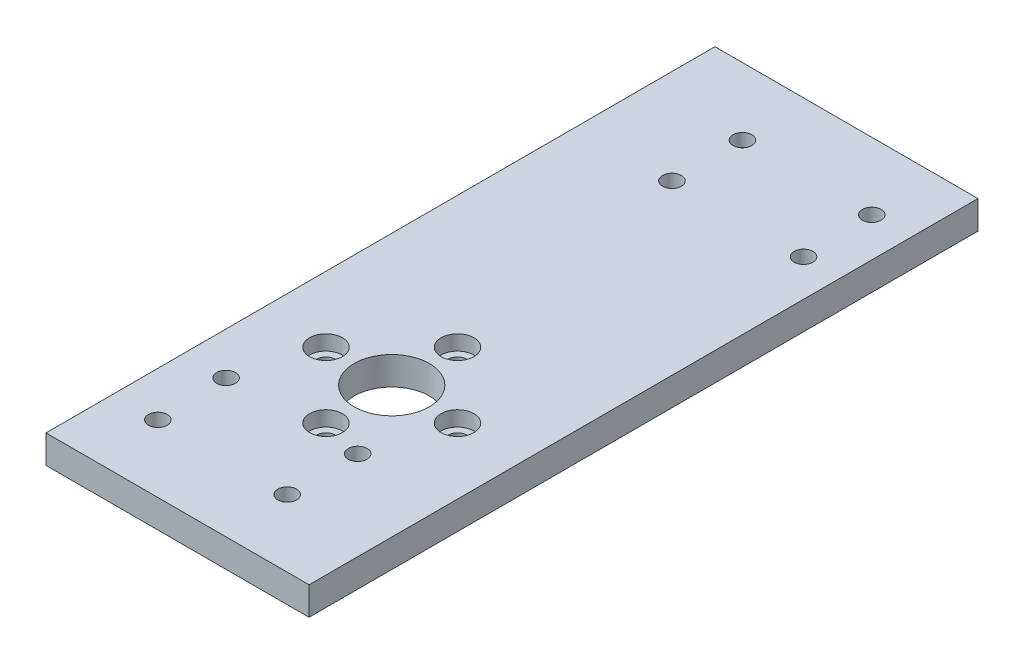
ISO-10303-21;
HEADER;
FILE_DESCRIPTION(('STEP AP214'),'2;1');
FILE_NAME('part.step','',(''),(''),'','','');
FILE_SCHEMA(('AUTOMOTIVE_DESIGN { 1 0 10303 214 1 1 1 1 }'));
ENDSEC;
DATA;
#1=APPLICATION_CONTEXT('core data for automotive mechanical design processes');
#2=APPLICATION_PROTOCOL_DEFINITION('international standard','automotive_design',2000,#1);
#3=PRODUCT_CONTEXT('',#1,'mechanical');
#4=PRODUCT('Part','Part','',(#3));
#5=PRODUCT_RELATED_PRODUCT_CATEGORY('part','',(#4));
#6=PRODUCT_DEFINITION_FORMATION('','',#4);
#7=PRODUCT_DEFINITION_CONTEXT('part definition',#1,'design');
#8=PRODUCT_DEFINITION('design','',#6,#7);
#9=PRODUCT_DEFINITION_SHAPE('','',#8);
#10=(LENGTH_UNIT() NAMED_UNIT(*) SI_UNIT(.MILLI.,.METRE.));
#11=(NAMED_UNIT(*) PLANE_ANGLE_UNIT() SI_UNIT($,.RADIAN.));
#12=(NAMED_UNIT(*) SI_UNIT($,.STERADIAN.) SOLID_ANGLE_UNIT());
#13=UNCERTAINTY_MEASURE_WITH_UNIT(LENGTH_MEASURE(1.E-05),#10,'distance_accuracy_value','');
#14=(GEOMETRIC_REPRESENTATION_CONTEXT(3) GLOBAL_UNCERTAINTY_ASSIGNED_CONTEXT((#13)) GLOBAL_UNIT_ASSIGNED_CONTEXT((#10,
#11,#12)) REPRESENTATION_CONTEXT('',''));
#15=CARTESIAN_POINT('',(0.,0.,0.));
#16=DIRECTION('',(0.,0.,1.));
#17=DIRECTION('',(1.,0.,0.));
#18=AXIS2_PLACEMENT_3D('',#15,#16,#17);
#19=CARTESIAN_POINT('',(-3.91877513505073,-7.,-28.4481628818932));
#20=DIRECTION('',(0.,1.,0.));
#21=DIRECTION('',(0.,0.,1.));
#22=AXIS2_PLACEMENT_3D('',#19,#20,#21);
#23=CYLINDRICAL_SURFACE('',#22,1.00000000000001);
#24=CARTESIAN_POINT('',(-3.91877513505073,3.,-28.4481628818932));
#25=DIRECTION('',(0.,1.,0.));
#26=DIRECTION('',(0.,0.,1.));
#27=AXIS2_PLACEMENT_3D('',#24,#25,#26);
#28=CIRCLE('',#27,1.00000000000001);
#29=CARTESIAN_POINT('',(-3.91877513505073,3.,-27.4481628818932));
#30=VERTEX_POINT('',#29);
#31=EDGE_CURVE('E241',#30,#30,#28,.T.);
#32=ORIENTED_EDGE('',*,*,#31,.T.);
#33=EDGE_LOOP('',(#32));
#34=FACE_BOUND('',#33,.T.);
#35=CARTESIAN_POINT('',(-3.91877513505073,1.6,-28.4481628818932));
#36=DIRECTION('',(0.,-1.,0.));
#37=DIRECTION('',(0.,0.,-1.));
#38=AXIS2_PLACEMENT_3D('',#35,#36,#37);
#39=CIRCLE('',#38,1.00000000000001);
#40=CARTESIAN_POINT('',(-3.91877513505073,1.6,-29.4481628818932));
#41=VERTEX_POINT('',#40);
#42=EDGE_CURVE('E40',#41,#41,#39,.F.);
#43=ORIENTED_EDGE('',*,*,#42,.F.);
#44=EDGE_LOOP('',(#43));
#45=FACE_BOUND('',#44,.T.);
#46=ADVANCED_FACE('F36',(#34,#45),#23,.F.);
#47=CARTESIAN_POINT('',(4.51877513505392,-7.,20.9481628818913));
#48=DIRECTION('',(0.,1.,0.));
#49=DIRECTION('',(0.,0.,1.));
#50=AXIS2_PLACEMENT_3D('',#47,#48,#49);
#51=CYLINDRICAL_SURFACE('',#50,1.00000000000002);
#52=CARTESIAN_POINT('',(4.51877513505392,3.,20.9481628818913));
#53=DIRECTION('',(0.,1.,0.));
#54=DIRECTION('',(0.,0.,1.));
#55=AXIS2_PLACEMENT_3D('',#52,#53,#54);
#56=CIRCLE('',#55,1.00000000000002);
#57=CARTESIAN_POINT('',(4.51877513505392,3.,21.9481628818913));
#58=VERTEX_POINT('',#57);
#59=EDGE_CURVE('E244',#58,#58,#56,.T.);
#60=ORIENTED_EDGE('',*,*,#59,.T.);
#61=EDGE_LOOP('',(#60));
#62=FACE_BOUND('',#61,.T.);
#63=CARTESIAN_POINT('',(4.51877513505392,1.6,20.9481628818913));
#64=DIRECTION('',(0.,-1.,0.));
#65=DIRECTION('',(0.,0.,-1.));
#66=AXIS2_PLACEMENT_3D('',#63,#64,#65);
#67=CIRCLE('',#66,1.00000000000002);
#68=CARTESIAN_POINT('',(4.51877513505392,1.6,19.9481628818913));
#69=VERTEX_POINT('',#68);
#70=EDGE_CURVE('E176',#69,#69,#67,.F.);
#71=ORIENTED_EDGE('',*,*,#70,.F.);
#72=EDGE_LOOP('',(#71));
#73=FACE_BOUND('',#72,.T.);
#74=ADVANCED_FACE('F277',(#62,#73),#51,.F.);
#75=CARTESIAN_POINT('',(4.51877513505393,-7.,28.4481628818913));
#76=DIRECTION('',(0.,1.,0.));
#77=DIRECTION('',(0.,0.,1.));
#78=AXIS2_PLACEMENT_3D('',#75,#76,#77);
#79=CYLINDRICAL_SURFACE('',#78,1.00000000000002);
#80=CARTESIAN_POINT('',(4.51877513505393,3.,28.4481628818913));
#81=DIRECTION('',(0.,1.,0.));
#82=DIRECTION('',(0.,0.,1.));
#83=AXIS2_PLACEMENT_3D('',#80,#81,#82);
#84=CIRCLE('',#83,1.00000000000002);
#85=CARTESIAN_POINT('',(4.51877513505393,3.,29.4481628818913));
#86=VERTEX_POINT('',#85);
#87=EDGE_CURVE('E247',#86,#86,#84,.T.);
#88=ORIENTED_EDGE('',*,*,#87,.T.);
#89=EDGE_LOOP('',(#88));
#90=FACE_BOUND('',#89,.T.);
#91=CARTESIAN_POINT('',(4.51877513505393,1.6,28.4481628818913));
#92=DIRECTION('',(0.,-1.,0.));
#93=DIRECTION('',(0.,0.,-1.));
#94=AXIS2_PLACEMENT_3D('',#91,#92,#93);
#95=CIRCLE('',#94,1.00000000000002);
#96=CARTESIAN_POINT('',(4.51877513505393,1.6,27.4481628818913));
#97=VERTEX_POINT('',#96);
#98=EDGE_CURVE('E172',#97,#97,#95,.F.);
#99=ORIENTED_EDGE('',*,*,#98,.F.);
#100=EDGE_LOOP('',(#99));
#101=FACE_BOUND('',#100,.T.);
#102=ADVANCED_FACE('F283',(#90,#101),#79,.F.);
#103=CARTESIAN_POINT('',(-9.48122486494609,-7.,20.9481628818913));
#104=DIRECTION('',(0.,1.,0.));
#105=DIRECTION('',(0.,0.,1.));
#106=AXIS2_PLACEMENT_3D('',#103,#104,#105);
#107=CYLINDRICAL_SURFACE('',#106,1.00000000000001);
#108=CARTESIAN_POINT('',(-9.48122486494609,3.,20.9481628818913));
#109=DIRECTION('',(0.,1.,0.));
#110=DIRECTION('',(0.,0.,1.));
#111=AXIS2_PLACEMENT_3D('',#108,#109,#110);
#112=CIRCLE('',#111,1.00000000000001);
#113=CARTESIAN_POINT('',(-9.48122486494609,3.,21.9481628818913));
#114=VERTEX_POINT('',#113);
#115=EDGE_CURVE('E253',#114,#114,#112,.T.);
#116=ORIENTED_EDGE('',*,*,#115,.T.);
#117=EDGE_LOOP('',(#116));
#118=FACE_BOUND('',#117,.T.);
#119=CARTESIAN_POINT('',(-9.48122486494609,1.6,20.9481628818913));
#120=DIRECTION('',(0.,-1.,0.));
#121=DIRECTION('',(0.,0.,-1.));
#122=AXIS2_PLACEMENT_3D('',#119,#120,#121);
#123=CIRCLE('',#122,1.00000000000001);
#124=CARTESIAN_POINT('',(-9.48122486494609,1.6,19.9481628818913));
#125=VERTEX_POINT('',#124);
#126=EDGE_CURVE('E167',#125,#125,#123,.F.);
#127=ORIENTED_EDGE('',*,*,#126,.F.);
#128=EDGE_LOOP('',(#127));
#129=FACE_BOUND('',#128,.T.);
#130=ADVANCED_FACE('F293',(#118,#129),#107,.F.);
#131=CARTESIAN_POINT('',(-9.24883244467996,-7.,28.4481628818913));
#132=DIRECTION('',(0.,1.,0.));
#133=DIRECTION('',(0.,0.,1.));
#134=AXIS2_PLACEMENT_3D('',#131,#132,#133);
#135=CYLINDRICAL_SURFACE('',#134,1.00000000000001);
#136=CARTESIAN_POINT('',(-9.24883244467996,3.,28.4481628818913));
#137=DIRECTION('',(0.,1.,0.));
#138=DIRECTION('',(0.,0.,1.));
#139=AXIS2_PLACEMENT_3D('',#136,#137,#138);
#140=CIRCLE('',#139,1.00000000000001);
#141=CARTESIAN_POINT('',(-9.24883244467996,3.,29.4481628818913));
#142=VERTEX_POINT('',#141);
#143=EDGE_CURVE('E250',#142,#142,#140,.T.);
#144=ORIENTED_EDGE('',*,*,#143,.T.);
#145=EDGE_LOOP('',(#144));
#146=FACE_BOUND('',#145,.T.);
#147=CARTESIAN_POINT('',(-9.24883244467996,1.6,28.4481628818913));
#148=DIRECTION('',(0.,-1.,0.));
#149=DIRECTION('',(0.,0.,-1.));
#150=AXIS2_PLACEMENT_3D('',#147,#148,#149);
#151=CIRCLE('',#150,1.00000000000001);
#152=CARTESIAN_POINT('',(-9.24883244467996,1.6,27.4481628818913));
#153=VERTEX_POINT('',#152);
#154=EDGE_CURVE('E162',#153,#153,#151,.F.);
#155=ORIENTED_EDGE('',*,*,#154,.F.);
#156=EDGE_LOOP('',(#155));
#157=FACE_BOUND('',#156,.T.);
#158=ADVANCED_FACE('F295',(#146,#157),#135,.F.);
#159=CARTESIAN_POINT('',(10.0812248649493,-7.,-20.9481628818932));
#160=DIRECTION('',(0.,1.,0.));
#161=DIRECTION('',(0.,0.,1.));
#162=AXIS2_PLACEMENT_3D('',#159,#160,#161);
#163=CYLINDRICAL_SURFACE('',#162,1.);
#164=CARTESIAN_POINT('',(10.0812248649493,3.,-20.9481628818932));
#165=DIRECTION('',(0.,1.,0.));
#166=DIRECTION('',(0.,0.,1.));
#167=AXIS2_PLACEMENT_3D('',#164,#165,#166);
#168=CIRCLE('',#167,1.);
#169=CARTESIAN_POINT('',(10.0812248649493,3.,-19.9481628818932));
#170=VERTEX_POINT('',#169);
#171=EDGE_CURVE('E235',#170,#170,#168,.T.);
#172=ORIENTED_EDGE('',*,*,#171,.T.);
#173=EDGE_LOOP('',(#172));
#174=FACE_BOUND('',#173,.T.);
#175=CARTESIAN_POINT('',(10.0812248649493,1.6,-20.9481628818932));
#176=DIRECTION('',(0.,-1.,0.));
#177=DIRECTION('',(0.,0.,-1.));
#178=AXIS2_PLACEMENT_3D('',#175,#176,#177);
#179=CIRCLE('',#178,1.);
#180=CARTESIAN_POINT('',(10.0812248649493,1.6,-21.9481628818932));
#181=VERTEX_POINT('',#180);
#182=EDGE_CURVE('E157',#181,#181,#179,.F.);
#183=ORIENTED_EDGE('',*,*,#182,.F.);
#184=EDGE_LOOP('',(#183));
#185=FACE_BOUND('',#184,.T.);
#186=ADVANCED_FACE('F298',(#174,#185),#163,.F.);
#187=CARTESIAN_POINT('',(9.84883244468316,-7.,-28.4481628818932));
#188=DIRECTION('',(0.,1.,0.));
#189=DIRECTION('',(0.,0.,1.));
#190=AXIS2_PLACEMENT_3D('',#187,#188,#189);
#191=CYLINDRICAL_SURFACE('',#190,1.00000000000001);
#192=CARTESIAN_POINT('',(9.84883244468316,3.,-28.4481628818932));
#193=DIRECTION('',(0.,1.,0.));
#194=DIRECTION('',(0.,0.,1.));
#195=AXIS2_PLACEMENT_3D('',#192,#193,#194);
#196=CIRCLE('',#195,1.00000000000001);
#197=CARTESIAN_POINT('',(9.84883244468316,3.,-27.4481628818932));
#198=VERTEX_POINT('',#197);
#199=EDGE_CURVE('E238',#198,#198,#196,.T.);
#200=ORIENTED_EDGE('',*,*,#199,.T.);
#201=EDGE_LOOP('',(#200));
#202=FACE_BOUND('',#201,.T.);
#203=CARTESIAN_POINT('',(9.84883244468316,1.6,-28.4481628818932));
#204=DIRECTION('',(0.,-1.,0.));
#205=DIRECTION('',(0.,0.,-1.));
#206=AXIS2_PLACEMENT_3D('',#203,#204,#205);
#207=CIRCLE('',#206,1.00000000000001);
#208=CARTESIAN_POINT('',(9.84883244468316,1.6,-29.4481628818932));
#209=VERTEX_POINT('',#208);
#210=EDGE_CURVE('E152',#209,#209,#207,.F.);
#211=ORIENTED_EDGE('',*,*,#210,.F.);
#212=EDGE_LOOP('',(#211));
#213=FACE_BOUND('',#212,.T.);
#214=ADVANCED_FACE('F288',(#202,#213),#191,.F.);
#215=CARTESIAN_POINT('',(-3.91877513505072,-7.,-20.9481628818932));
#216=DIRECTION('',(0.,1.,0.));
#217=DIRECTION('',(0.,0.,1.));
#218=AXIS2_PLACEMENT_3D('',#215,#216,#217);
#219=CYLINDRICAL_SURFACE('',#218,1.00000000000001);
#220=CARTESIAN_POINT('',(-3.91877513505072,3.,-20.9481628818932));
#221=DIRECTION('',(0.,1.,0.));
#222=DIRECTION('',(0.,0.,1.));
#223=AXIS2_PLACEMENT_3D('',#220,#221,#222);
#224=CIRCLE('',#223,1.00000000000001);
#225=CARTESIAN_POINT('',(-3.91877513505072,3.,-19.9481628818932));
#226=VERTEX_POINT('',#225);
#227=EDGE_CURVE('E130',#226,#226,#224,.T.);
#228=ORIENTED_EDGE('',*,*,#227,.T.);
#229=EDGE_LOOP('',(#228));
#230=FACE_BOUND('',#229,.T.);
#231=CARTESIAN_POINT('',(-3.91877513505072,1.6,-20.9481628818932));
#232=DIRECTION('',(0.,-1.,0.));
#233=DIRECTION('',(0.,0.,-1.));
#234=AXIS2_PLACEMENT_3D('',#231,#232,#233);
#235=CIRCLE('',#234,1.00000000000001);
#236=CARTESIAN_POINT('',(-3.91877513505072,1.6,-21.9481628818932));
#237=VERTEX_POINT('',#236);
#238=EDGE_CURVE('E147',#237,#237,#235,.F.);
#239=ORIENTED_EDGE('',*,*,#238,.F.);
#240=EDGE_LOOP('',(#239));
#241=FACE_BOUND('',#240,.T.);
#242=ADVANCED_FACE('F318',(#230,#241),#219,.F.);
#243=CARTESIAN_POINT('',(7.0000000000001,-7.,12.7999999999978));
#244=DIRECTION('',(0.,1.,0.));
#245=DIRECTION('',(0.,0.,1.));
#246=AXIS2_PLACEMENT_3D('',#243,#244,#245);
#247=CYLINDRICAL_SURFACE('',#246,1.);
#248=CARTESIAN_POINT('',(7.0000000000001,0.,12.7999999999978));
#249=DIRECTION('',(0.,-1.,0.));
#250=DIRECTION('',(0.,0.,-1.));
#251=AXIS2_PLACEMENT_3D('',#248,#249,#250);
#252=CIRCLE('',#251,1.);
#253=CARTESIAN_POINT('',(7.0000000000001,0.,11.7999999999978));
#254=VERTEX_POINT('',#253);
#255=EDGE_CURVE('E114',#254,#254,#252,.T.);
#256=ORIENTED_EDGE('',*,*,#255,.T.);
#257=EDGE_LOOP('',(#256));
#258=FACE_BOUND('',#257,.T.);
#259=CARTESIAN_POINT('',(7.0000000000001,1.4,12.7999999999978));
#260=DIRECTION('',(0.,1.,0.));
#261=DIRECTION('',(0.,0.,1.));
#262=AXIS2_PLACEMENT_3D('',#259,#260,#261);
#263=CIRCLE('',#262,1.);
#264=CARTESIAN_POINT('',(7.0000000000001,1.4,13.7999999999978));
#265=VERTEX_POINT('',#264);
#266=EDGE_CURVE('E142',#265,#265,#263,.F.);
#267=ORIENTED_EDGE('',*,*,#266,.F.);
#268=EDGE_LOOP('',(#267));
#269=FACE_BOUND('',#268,.T.);
#270=ADVANCED_FACE('F311',(#258,#269),#247,.F.);
#271=CARTESIAN_POINT('',(-6.9999999999999,-7.,12.7999999999979));
#272=DIRECTION('',(0.,1.,0.));
#273=DIRECTION('',(0.,0.,1.));
#274=AXIS2_PLACEMENT_3D('',#271,#272,#273);
#275=CYLINDRICAL_SURFACE('',#274,1.);
#276=CARTESIAN_POINT('',(-6.9999999999999,0.,12.7999999999979));
#277=DIRECTION('',(0.,-1.,0.));
#278=DIRECTION('',(0.,0.,-1.));
#279=AXIS2_PLACEMENT_3D('',#276,#277,#278);
#280=CIRCLE('',#279,1.);
#281=CARTESIAN_POINT('',(-6.9999999999999,0.,11.7999999999979));
#282=VERTEX_POINT('',#281);
#283=EDGE_CURVE('E120',#282,#282,#280,.T.);
#284=ORIENTED_EDGE('',*,*,#283,.T.);
#285=EDGE_LOOP('',(#284));
#286=FACE_BOUND('',#285,.T.);
#287=CARTESIAN_POINT('',(-6.9999999999999,1.4,12.7999999999979));
#288=DIRECTION('',(0.,1.,0.));
#289=DIRECTION('',(0.,0.,1.));
#290=AXIS2_PLACEMENT_3D('',#287,#288,#289);
#291=CIRCLE('',#290,1.);
#292=CARTESIAN_POINT('',(-6.9999999999999,1.4,13.7999999999979));
#293=VERTEX_POINT('',#292);
#294=EDGE_CURVE('E137',#293,#293,#291,.F.);
#295=ORIENTED_EDGE('',*,*,#294,.F.);
#296=EDGE_LOOP('',(#295));
#297=FACE_BOUND('',#296,.T.);
#298=ADVANCED_FACE('F307',(#286,#297),#275,.F.);
#299=CARTESIAN_POINT('',(0.,-7.,5.79999999999792));
#300=DIRECTION('',(0.,1.,0.));
#301=DIRECTION('',(0.,0.,1.));
#302=AXIS2_PLACEMENT_3D('',#299,#300,#301);
#303=CYLINDRICAL_SURFACE('',#302,1.);
#304=CARTESIAN_POINT('',(0.,0.,5.79999999999792));
#305=DIRECTION('',(0.,-1.,0.));
#306=DIRECTION('',(0.,0.,-1.));
#307=AXIS2_PLACEMENT_3D('',#304,#305,#306);
#308=CIRCLE('',#307,1.);
#309=CARTESIAN_POINT('',(0.,0.,4.79999999999792));
#310=VERTEX_POINT('',#309);
#311=EDGE_CURVE('E106',#310,#310,#308,.T.);
#312=ORIENTED_EDGE('',*,*,#311,.T.);
#313=EDGE_LOOP('',(#312));
#314=FACE_BOUND('',#313,.T.);
#315=CARTESIAN_POINT('',(0.,1.4,5.79999999999792));
#316=DIRECTION('',(0.,1.,0.));
#317=DIRECTION('',(0.,0.,1.));
#318=AXIS2_PLACEMENT_3D('',#315,#316,#317);
#319=CIRCLE('',#318,1.);
#320=CARTESIAN_POINT('',(0.,1.4,6.79999999999792));
#321=VERTEX_POINT('',#320);
#322=EDGE_CURVE('E132',#321,#321,#319,.F.);
#323=ORIENTED_EDGE('',*,*,#322,.F.);
#324=EDGE_LOOP('',(#323));
#325=FACE_BOUND('',#324,.T.);
#326=ADVANCED_FACE('F310',(#314,#325),#303,.F.);
#327=CARTESIAN_POINT('',(1.45764745514838E-13,-7.,19.7999999999979));
#328=DIRECTION('',(0.,1.,0.));
#329=DIRECTION('',(0.,0.,1.));
#330=AXIS2_PLACEMENT_3D('',#327,#328,#329);
#331=CYLINDRICAL_SURFACE('',#330,1.);
#332=CARTESIAN_POINT('',(1.45764745514838E-13,0.,19.7999999999979));
#333=DIRECTION('',(0.,-1.,0.));
#334=DIRECTION('',(0.,0.,-1.));
#335=AXIS2_PLACEMENT_3D('',#332,#333,#334);
#336=CIRCLE('',#335,1.);
#337=CARTESIAN_POINT('',(1.45764745514838E-13,0.,18.7999999999979));
#338=VERTEX_POINT('',#337);
#339=EDGE_CURVE('E117',#338,#338,#336,.T.);
#340=ORIENTED_EDGE('',*,*,#339,.T.);
#341=EDGE_LOOP('',(#340));
#342=FACE_BOUND('',#341,.T.);
#343=CARTESIAN_POINT('',(1.45764745514838E-13,1.4,19.7999999999979));
#344=DIRECTION('',(0.,1.,0.));
#345=DIRECTION('',(0.,0.,1.));
#346=AXIS2_PLACEMENT_3D('',#343,#344,#345);
#347=CIRCLE('',#346,1.);
#348=CARTESIAN_POINT('',(1.45764745514838E-13,1.4,20.7999999999979));
#349=VERTEX_POINT('',#348);
#350=EDGE_CURVE('E127',#349,#349,#347,.F.);
#351=ORIENTED_EDGE('',*,*,#350,.F.);
#352=EDGE_LOOP('',(#351));
#353=FACE_BOUND('',#352,.T.);
#354=ADVANCED_FACE('F313',(#342,#353),#331,.F.);
#355=CARTESIAN_POINT('',(14.,3.,35.6));
#356=DIRECTION('',(-1.,0.,0.));
#357=DIRECTION('',(0.,0.,1.));
#358=AXIS2_PLACEMENT_3D('',#355,#356,#357);
#359=PLANE('',#358);
#360=DIRECTION('',(0.,0.,-1.));
#361=VECTOR('',#360,1.);
#362=CARTESIAN_POINT('',(14.,0.,35.6));
#363=LINE('',#362,#361);
#364=CARTESIAN_POINT('',(14.,0.,35.6));
#365=VERTEX_POINT('',#364);
#366=CARTESIAN_POINT('',(14.,0.,-35.6));
#367=VERTEX_POINT('',#366);
#368=EDGE_CURVE('E103',#365,#367,#363,.T.);
#369=ORIENTED_EDGE('',*,*,#368,.T.);
#370=DIRECTION('',(0.,-1.,0.));
#371=VECTOR('',#370,1.);
#372=CARTESIAN_POINT('',(14.,3.,-35.6));
#373=LINE('',#372,#371);
#374=CARTESIAN_POINT('',(14.,3.,-35.6));
#375=VERTEX_POINT('',#374);
#376=EDGE_CURVE('E11',#375,#367,#373,.T.);
#377=ORIENTED_EDGE('',*,*,#376,.F.);
#378=DIRECTION('',(0.,0.,-1.));
#379=VECTOR('',#378,1.);
#380=CARTESIAN_POINT('',(14.,3.,35.6));
#381=LINE('',#380,#379);
#382=CARTESIAN_POINT('',(14.,3.,35.6));
#383=VERTEX_POINT('',#382);
#384=EDGE_CURVE('E90',#383,#375,#381,.T.);
#385=ORIENTED_EDGE('',*,*,#384,.F.);
#386=DIRECTION('',(0.,-1.,0.));
#387=VECTOR('',#386,1.);
#388=CARTESIAN_POINT('',(14.,3.,35.6));
#389=LINE('',#388,#387);
#390=EDGE_CURVE('E99',#383,#365,#389,.T.);
#391=ORIENTED_EDGE('',*,*,#390,.T.);
#392=EDGE_LOOP('',(#369,#377,#385,#391));
#393=FACE_BOUND('',#392,.T.);
#394=ADVANCED_FACE('F38',(#393),#359,.F.);
#395=CARTESIAN_POINT('',(-14.,3.,-35.6));
#396=DIRECTION('',(0.,0.,1.));
#397=DIRECTION('',(1.,0.,0.));
#398=AXIS2_PLACEMENT_3D('',#395,#396,#397);
#399=PLANE('',#398);
#400=DIRECTION('',(-1.,0.,0.));
#401=VECTOR('',#400,1.);
#402=CARTESIAN_POINT('',(-14.,0.,-35.6));
#403=LINE('',#402,#401);
#404=CARTESIAN_POINT('',(-14.,0.,-35.6));
#405=VERTEX_POINT('',#404);
#406=EDGE_CURVE('E94',#367,#405,#403,.T.);
#407=ORIENTED_EDGE('',*,*,#406,.T.);
#408=DIRECTION('',(0.,-1.,0.));
#409=VECTOR('',#408,1.);
#410=CARTESIAN_POINT('',(-14.,3.,-35.6));
#411=LINE('',#410,#409);
#412=CARTESIAN_POINT('',(-14.,3.,-35.6));
#413=VERTEX_POINT('',#412);
#414=EDGE_CURVE('E46',#413,#405,#411,.T.);
#415=ORIENTED_EDGE('',*,*,#414,.F.);
#416=DIRECTION('',(-1.,0.,0.));
#417=VECTOR('',#416,1.);
#418=CARTESIAN_POINT('',(-14.,3.,-35.6));
#419=LINE('',#418,#417);
#420=EDGE_CURVE('E85',#375,#413,#419,.T.);
#421=ORIENTED_EDGE('',*,*,#420,.F.);
#422=ORIENTED_EDGE('',*,*,#376,.T.);
#423=EDGE_LOOP('',(#407,#415,#421,#422));
#424=FACE_BOUND('',#423,.T.);
#425=ADVANCED_FACE('F93',(#424),#399,.F.);
#426=CARTESIAN_POINT('',(-14.,3.,35.6));
#427=DIRECTION('',(1.,0.,0.));
#428=DIRECTION('',(0.,0.,-1.));
#429=AXIS2_PLACEMENT_3D('',#426,#427,#428);
#430=PLANE('',#429);
#431=DIRECTION('',(0.,0.,1.));
#432=VECTOR('',#431,1.);
#433=CARTESIAN_POINT('',(-14.,0.,35.6));
#434=LINE('',#433,#432);
#435=CARTESIAN_POINT('',(-14.,0.,35.6));
#436=VERTEX_POINT('',#435);
#437=EDGE_CURVE('E72',#405,#436,#434,.T.);
#438=ORIENTED_EDGE('',*,*,#437,.T.);
#439=DIRECTION('',(0.,-1.,0.));
#440=VECTOR('',#439,1.);
#441=CARTESIAN_POINT('',(-14.,3.,35.6));
#442=LINE('',#441,#440);
#443=CARTESIAN_POINT('',(-14.,3.,35.6));
#444=VERTEX_POINT('',#443);
#445=EDGE_CURVE('E95',#444,#436,#442,.T.);
#446=ORIENTED_EDGE('',*,*,#445,.F.);
#447=DIRECTION('',(0.,0.,1.));
#448=VECTOR('',#447,1.);
#449=CARTESIAN_POINT('',(-14.,3.,35.6));
#450=LINE('',#449,#448);
#451=EDGE_CURVE('E88',#413,#444,#450,.T.);
#452=ORIENTED_EDGE('',*,*,#451,.F.);
#453=ORIENTED_EDGE('',*,*,#414,.T.);
#454=EDGE_LOOP('',(#438,#446,#452,#453));
#455=FACE_BOUND('',#454,.T.);
#456=ADVANCED_FACE('F97',(#455),#430,.F.);
#457=CARTESIAN_POINT('',(-14.,3.,35.6));
#458=DIRECTION('',(0.,0.,-1.));
#459=DIRECTION('',(-1.,0.,0.));
#460=AXIS2_PLACEMENT_3D('',#457,#458,#459);
#461=PLANE('',#460);
#462=DIRECTION('',(1.,0.,0.));
#463=VECTOR('',#462,1.);
#464=CARTESIAN_POINT('',(-14.,0.,35.6));
#465=LINE('',#464,#463);
#466=EDGE_CURVE('E78',#436,#365,#465,.T.);
#467=ORIENTED_EDGE('',*,*,#466,.T.);
#468=ORIENTED_EDGE('',*,*,#390,.F.);
#469=DIRECTION('',(1.,0.,0.));
#470=VECTOR('',#469,1.);
#471=CARTESIAN_POINT('',(-14.,3.,35.6));
#472=LINE('',#471,#470);
#473=EDGE_CURVE('E55',#444,#383,#472,.T.);
#474=ORIENTED_EDGE('',*,*,#473,.F.);
#475=ORIENTED_EDGE('',*,*,#445,.T.);
#476=EDGE_LOOP('',(#467,#468,#474,#475));
#477=FACE_BOUND('',#476,.T.);
#478=ADVANCED_FACE('F263',(#477),#461,.F.);
#479=CARTESIAN_POINT('',(0.,3.,0.));
#480=DIRECTION('',(0.,-1.,0.));
#481=DIRECTION('',(0.,0.,-1.));
#482=AXIS2_PLACEMENT_3D('',#479,#480,#481);
#483=PLANE('',#482);
#484=CARTESIAN_POINT('',(7.0000000000001,3.,12.7999999999978));
#485=DIRECTION('',(0.,1.,0.));
#486=DIRECTION('',(0.,0.,1.));
#487=AXIS2_PLACEMENT_3D('',#484,#485,#486);
#488=CIRCLE('',#487,1.75);
#489=CARTESIAN_POINT('',(7.0000000000001,3.,14.5499999999978));
#490=VERTEX_POINT('',#489);
#491=EDGE_CURVE('E150',#490,#490,#488,.T.);
#492=ORIENTED_EDGE('',*,*,#491,.F.);
#493=EDGE_LOOP('',(#492));
#494=FACE_BOUND('',#493,.T.);
#495=CARTESIAN_POINT('',(-6.9999999999999,3.,12.7999999999979));
#496=DIRECTION('',(0.,1.,0.));
#497=DIRECTION('',(0.,0.,1.));
#498=AXIS2_PLACEMENT_3D('',#495,#496,#497);
#499=CIRCLE('',#498,1.75);
#500=CARTESIAN_POINT('',(-6.9999999999999,3.,14.5499999999979));
#501=VERTEX_POINT('',#500);
#502=EDGE_CURVE('E145',#501,#501,#499,.T.);
#503=ORIENTED_EDGE('',*,*,#502,.F.);
#504=EDGE_LOOP('',(#503));
#505=FACE_BOUND('',#504,.T.);
#506=CARTESIAN_POINT('',(0.,3.,5.79999999999792));
#507=DIRECTION('',(0.,1.,0.));
#508=DIRECTION('',(0.,0.,1.));
#509=AXIS2_PLACEMENT_3D('',#506,#507,#508);
#510=CIRCLE('',#509,1.75);
#511=CARTESIAN_POINT('',(0.,3.,7.54999999999792));
#512=VERTEX_POINT('',#511);
#513=EDGE_CURVE('E140',#512,#512,#510,.T.);
#514=ORIENTED_EDGE('',*,*,#513,.F.);
#515=EDGE_LOOP('',(#514));
#516=FACE_BOUND('',#515,.T.);
#517=CARTESIAN_POINT('',(1.45764745514838E-13,3.,19.7999999999979));
#518=DIRECTION('',(0.,1.,0.));
#519=DIRECTION('',(0.,0.,1.));
#520=AXIS2_PLACEMENT_3D('',#517,#518,#519);
#521=CIRCLE('',#520,1.75);
#522=CARTESIAN_POINT('',(1.45764745514838E-13,3.,21.5499999999979));
#523=VERTEX_POINT('',#522);
#524=EDGE_CURVE('E135',#523,#523,#521,.T.);
#525=ORIENTED_EDGE('',*,*,#524,.F.);
#526=EDGE_LOOP('',(#525));
#527=FACE_BOUND('',#526,.T.);
#528=ORIENTED_EDGE('',*,*,#227,.F.);
#529=EDGE_LOOP('',(#528));
#530=FACE_BOUND('',#529,.T.);
#531=ORIENTED_EDGE('',*,*,#171,.F.);
#532=EDGE_LOOP('',(#531));
#533=FACE_BOUND('',#532,.T.);
#534=ORIENTED_EDGE('',*,*,#199,.F.);
#535=EDGE_LOOP('',(#534));
#536=FACE_BOUND('',#535,.T.);
#537=ORIENTED_EDGE('',*,*,#31,.F.);
#538=EDGE_LOOP('',(#537));
#539=FACE_BOUND('',#538,.T.);
#540=ORIENTED_EDGE('',*,*,#59,.F.);
#541=EDGE_LOOP('',(#540));
#542=FACE_BOUND('',#541,.T.);
#543=ORIENTED_EDGE('',*,*,#87,.F.);
#544=EDGE_LOOP('',(#543));
#545=FACE_BOUND('',#544,.T.);
#546=ORIENTED_EDGE('',*,*,#143,.F.);
#547=EDGE_LOOP('',(#546));
#548=FACE_BOUND('',#547,.T.);
#549=ORIENTED_EDGE('',*,*,#115,.F.);
#550=EDGE_LOOP('',(#549));
#551=FACE_BOUND('',#550,.T.);
#552=CARTESIAN_POINT('',(0.,3.,12.7999999999985));
#553=DIRECTION('',(0.,1.,0.));
#554=DIRECTION('',(0.,0.,1.));
#555=AXIS2_PLACEMENT_3D('',#552,#553,#554);
#556=CIRCLE('',#555,4.);
#557=CARTESIAN_POINT('',(0.,3.,16.7999999999985));
#558=VERTEX_POINT('',#557);
#559=EDGE_CURVE('E126',#558,#558,#556,.T.);
#560=ORIENTED_EDGE('',*,*,#559,.F.);
#561=EDGE_LOOP('',(#560));
#562=FACE_BOUND('',#561,.T.);
#563=ORIENTED_EDGE('',*,*,#384,.T.);
#564=ORIENTED_EDGE('',*,*,#420,.T.);
#565=ORIENTED_EDGE('',*,*,#451,.T.);
#566=ORIENTED_EDGE('',*,*,#473,.T.);
#567=EDGE_LOOP('',(#563,#564,#565,#566));
#568=FACE_BOUND('',#567,.T.);
#569=ADVANCED_FACE('F86',(#494,#505,#516,#527,#530,#533,#536,#539,#542,#545,#548,#551,#562,
#568),#483,.F.);
#570=CARTESIAN_POINT('',(0.,0.,0.));
#571=DIRECTION('',(0.,-1.,0.));
#572=DIRECTION('',(0.,0.,-1.));
#573=AXIS2_PLACEMENT_3D('',#570,#571,#572);
#574=PLANE('',#573);
#575=CARTESIAN_POINT('',(-3.91877513505052,0.,-28.4481628818932));
#576=DIRECTION('',(0.,-1.,0.));
#577=DIRECTION('',(0.,0.,-1.));
#578=AXIS2_PLACEMENT_3D('',#575,#576,#577);
#579=CIRCLE('',#578,1.75);
#580=CARTESIAN_POINT('',(-3.91877513505052,0.,-30.1981628818932));
#581=VERTEX_POINT('',#580);
#582=EDGE_CURVE('E192',#581,#581,#579,.T.);
#583=ORIENTED_EDGE('',*,*,#582,.F.);
#584=EDGE_LOOP('',(#583));
#585=FACE_BOUND('',#584,.T.);
#586=CARTESIAN_POINT('',(4.51877513505412,0.,20.9481628818913));
#587=DIRECTION('',(0.,-1.,0.));
#588=DIRECTION('',(0.,0.,-1.));
#589=AXIS2_PLACEMENT_3D('',#586,#587,#588);
#590=CIRCLE('',#589,1.74999999999999);
#591=CARTESIAN_POINT('',(4.51877513505412,0.,19.1981628818913));
#592=VERTEX_POINT('',#591);
#593=EDGE_CURVE('E185',#592,#592,#590,.T.);
#594=ORIENTED_EDGE('',*,*,#593,.F.);
#595=EDGE_LOOP('',(#594));
#596=FACE_BOUND('',#595,.T.);
#597=CARTESIAN_POINT('',(4.51877513505413,0.,28.4481628818913));
#598=DIRECTION('',(0.,-1.,0.));
#599=DIRECTION('',(0.,0.,-1.));
#600=AXIS2_PLACEMENT_3D('',#597,#598,#599);
#601=CIRCLE('',#600,1.74999999999999);
#602=CARTESIAN_POINT('',(4.51877513505413,0.,26.6981628818913));
#603=VERTEX_POINT('',#602);
#604=EDGE_CURVE('E178',#603,#603,#601,.T.);
#605=ORIENTED_EDGE('',*,*,#604,.F.);
#606=EDGE_LOOP('',(#605));
#607=FACE_BOUND('',#606,.T.);
#608=CARTESIAN_POINT('',(-9.48122486494588,0.,20.9481628818913));
#609=DIRECTION('',(0.,-1.,0.));
#610=DIRECTION('',(0.,0.,-1.));
#611=AXIS2_PLACEMENT_3D('',#608,#609,#610);
#612=CIRCLE('',#611,1.75000000000001);
#613=CARTESIAN_POINT('',(-9.48122486494588,0.,19.1981628818913));
#614=VERTEX_POINT('',#613);
#615=EDGE_CURVE('E174',#614,#614,#612,.T.);
#616=ORIENTED_EDGE('',*,*,#615,.F.);
#617=EDGE_LOOP('',(#616));
#618=FACE_BOUND('',#617,.T.);
#619=CARTESIAN_POINT('',(-9.24883244467975,0.,28.4481628818914));
#620=DIRECTION('',(0.,-1.,0.));
#621=DIRECTION('',(0.,0.,-1.));
#622=AXIS2_PLACEMENT_3D('',#619,#620,#621);
#623=CIRCLE('',#622,1.75000000000001);
#624=CARTESIAN_POINT('',(-9.24883244467975,0.,26.6981628818913));
#625=VERTEX_POINT('',#624);
#626=EDGE_CURVE('E170',#625,#625,#623,.T.);
#627=ORIENTED_EDGE('',*,*,#626,.F.);
#628=EDGE_LOOP('',(#627));
#629=FACE_BOUND('',#628,.T.);
#630=CARTESIAN_POINT('',(10.0812248649495,0.,-20.9481628818932));
#631=DIRECTION('',(0.,-1.,0.));
#632=DIRECTION('',(0.,0.,-1.));
#633=AXIS2_PLACEMENT_3D('',#630,#631,#632);
#634=CIRCLE('',#633,1.75);
#635=CARTESIAN_POINT('',(10.0812248649495,0.,-22.6981628818932));
#636=VERTEX_POINT('',#635);
#637=EDGE_CURVE('E165',#636,#636,#634,.T.);
#638=ORIENTED_EDGE('',*,*,#637,.F.);
#639=EDGE_LOOP('',(#638));
#640=FACE_BOUND('',#639,.T.);
#641=CARTESIAN_POINT('',(9.84883244468337,0.,-28.4481628818932));
#642=DIRECTION('',(0.,-1.,0.));
#643=DIRECTION('',(0.,0.,-1.));
#644=AXIS2_PLACEMENT_3D('',#641,#642,#643);
#645=CIRCLE('',#644,1.75);
#646=CARTESIAN_POINT('',(9.84883244468337,0.,-30.1981628818932));
#647=VERTEX_POINT('',#646);
#648=EDGE_CURVE('E160',#647,#647,#645,.T.);
#649=ORIENTED_EDGE('',*,*,#648,.F.);
#650=EDGE_LOOP('',(#649));
#651=FACE_BOUND('',#650,.T.);
#652=CARTESIAN_POINT('',(-3.91877513505052,0.,-20.9481628818932));
#653=DIRECTION('',(0.,-1.,0.));
#654=DIRECTION('',(0.,0.,-1.));
#655=AXIS2_PLACEMENT_3D('',#652,#653,#654);
#656=CIRCLE('',#655,1.75000000000001);
#657=CARTESIAN_POINT('',(-3.91877513505052,0.,-22.6981628818932));
#658=VERTEX_POINT('',#657);
#659=EDGE_CURVE('E155',#658,#658,#656,.T.);
#660=ORIENTED_EDGE('',*,*,#659,.F.);
#661=EDGE_LOOP('',(#660));
#662=FACE_BOUND('',#661,.T.);
#663=CARTESIAN_POINT('',(0.,0.,12.7999999999985));
#664=DIRECTION('',(0.,-1.,0.));
#665=DIRECTION('',(0.,0.,-1.));
#666=AXIS2_PLACEMENT_3D('',#663,#664,#665);
#667=CIRCLE('',#666,4.);
#668=CARTESIAN_POINT('',(0.,0.,8.79999999999852));
#669=VERTEX_POINT('',#668);
#670=EDGE_CURVE('E123',#669,#669,#667,.T.);
#671=ORIENTED_EDGE('',*,*,#670,.F.);
#672=EDGE_LOOP('',(#671));
#673=FACE_BOUND('',#672,.T.);
#674=ORIENTED_EDGE('',*,*,#283,.F.);
#675=EDGE_LOOP('',(#674));
#676=FACE_BOUND('',#675,.T.);
#677=ORIENTED_EDGE('',*,*,#339,.F.);
#678=EDGE_LOOP('',(#677));
#679=FACE_BOUND('',#678,.T.);
#680=ORIENTED_EDGE('',*,*,#255,.F.);
#681=EDGE_LOOP('',(#680));
#682=FACE_BOUND('',#681,.T.);
#683=ORIENTED_EDGE('',*,*,#311,.F.);
#684=EDGE_LOOP('',(#683));
#685=FACE_BOUND('',#684,.T.);
#686=ORIENTED_EDGE('',*,*,#368,.F.);
#687=ORIENTED_EDGE('',*,*,#466,.F.);
#688=ORIENTED_EDGE('',*,*,#437,.F.);
#689=ORIENTED_EDGE('',*,*,#406,.F.);
#690=EDGE_LOOP('',(#686,#687,#688,#689));
#691=FACE_BOUND('',#690,.T.);
#692=ADVANCED_FACE('F262',(#585,#596,#607,#618,#629,#640,#651,#662,#673,#676,#679,#682,#685,
#691),#574,.T.);
#693=CARTESIAN_POINT('',(0.,-7.,12.7999999999985));
#694=DIRECTION('',(0.,1.,0.));
#695=DIRECTION('',(0.,0.,1.));
#696=AXIS2_PLACEMENT_3D('',#693,#694,#695);
#697=CYLINDRICAL_SURFACE('',#696,4.);
#698=ORIENTED_EDGE('',*,*,#670,.T.);
#699=EDGE_LOOP('',(#698));
#700=FACE_BOUND('',#699,.T.);
#701=ORIENTED_EDGE('',*,*,#559,.T.);
#702=EDGE_LOOP('',(#701));
#703=FACE_BOUND('',#702,.T.);
#704=ADVANCED_FACE('F259',(#700,#703),#697,.F.);
#705=CARTESIAN_POINT('',(1.45764745514838E-13,1.4,19.7999999999979));
#706=DIRECTION('',(0.,1.,0.));
#707=DIRECTION('',(0.,0.,1.));
#708=AXIS2_PLACEMENT_3D('',#705,#706,#707);
#709=PLANE('',#708);
#710=CARTESIAN_POINT('',(1.45764745514838E-13,1.4,19.7999999999979));
#711=DIRECTION('',(0.,1.,0.));
#712=DIRECTION('',(0.,0.,1.));
#713=AXIS2_PLACEMENT_3D('',#710,#711,#712);
#714=CIRCLE('',#713,1.75);
#715=CARTESIAN_POINT('',(1.45764745514838E-13,1.4,21.5499999999979));
#716=VERTEX_POINT('',#715);
#717=EDGE_CURVE('E131',#716,#716,#714,.T.);
#718=ORIENTED_EDGE('',*,*,#717,.T.);
#719=EDGE_LOOP('',(#718));
#720=FACE_BOUND('',#719,.T.);
#721=ORIENTED_EDGE('',*,*,#350,.T.);
#722=EDGE_LOOP('',(#721));
#723=FACE_BOUND('',#722,.T.);
#724=ADVANCED_FACE('F305',(#720,#723),#709,.T.);
#725=CARTESIAN_POINT('',(1.45764745514838E-13,1.4,19.7999999999979));
#726=DIRECTION('',(0.,1.,0.));
#727=DIRECTION('',(0.,0.,1.));
#728=AXIS2_PLACEMENT_3D('',#725,#726,#727);
#729=CYLINDRICAL_SURFACE('',#728,1.75);
#730=ORIENTED_EDGE('',*,*,#717,.F.);
#731=EDGE_LOOP('',(#730));
#732=FACE_BOUND('',#731,.T.);
#733=ORIENTED_EDGE('',*,*,#524,.T.);
#734=EDGE_LOOP('',(#733));
#735=FACE_BOUND('',#734,.T.);
#736=ADVANCED_FACE('F331',(#732,#735),#729,.F.);
#737=CARTESIAN_POINT('',(0.,1.4,5.79999999999792));
#738=DIRECTION('',(0.,1.,0.));
#739=DIRECTION('',(0.,0.,1.));
#740=AXIS2_PLACEMENT_3D('',#737,#738,#739);
#741=PLANE('',#740);
#742=CARTESIAN_POINT('',(0.,1.4,5.79999999999792));
#743=DIRECTION('',(0.,1.,0.));
#744=DIRECTION('',(0.,0.,1.));
#745=AXIS2_PLACEMENT_3D('',#742,#743,#744);
#746=CIRCLE('',#745,1.75);
#747=CARTESIAN_POINT('',(0.,1.4,7.54999999999792));
#748=VERTEX_POINT('',#747);
#749=EDGE_CURVE('E136',#748,#748,#746,.T.);
#750=ORIENTED_EDGE('',*,*,#749,.T.);
#751=EDGE_LOOP('',(#750));
#752=FACE_BOUND('',#751,.T.);
#753=ORIENTED_EDGE('',*,*,#322,.T.);
#754=EDGE_LOOP('',(#753));
#755=FACE_BOUND('',#754,.T.);
#756=ADVANCED_FACE('F328',(#752,#755),#741,.T.);
#757=CARTESIAN_POINT('',(0.,1.4,5.79999999999792));
#758=DIRECTION('',(0.,1.,0.));
#759=DIRECTION('',(0.,0.,1.));
#760=AXIS2_PLACEMENT_3D('',#757,#758,#759);
#761=CYLINDRICAL_SURFACE('',#760,1.75);
#762=ORIENTED_EDGE('',*,*,#749,.F.);
#763=EDGE_LOOP('',(#762));
#764=FACE_BOUND('',#763,.T.);
#765=ORIENTED_EDGE('',*,*,#513,.T.);
#766=EDGE_LOOP('',(#765));
#767=FACE_BOUND('',#766,.T.);
#768=ADVANCED_FACE('F330',(#764,#767),#761,.F.);
#769=CARTESIAN_POINT('',(-6.9999999999999,1.4,12.7999999999979));
#770=DIRECTION('',(0.,1.,0.));
#771=DIRECTION('',(0.,0.,1.));
#772=AXIS2_PLACEMENT_3D('',#769,#770,#771);
#773=PLANE('',#772);
#774=CARTESIAN_POINT('',(-6.9999999999999,1.4,12.7999999999979));
#775=DIRECTION('',(0.,1.,0.));
#776=DIRECTION('',(0.,0.,1.));
#777=AXIS2_PLACEMENT_3D('',#774,#775,#776);
#778=CIRCLE('',#777,1.75);
#779=CARTESIAN_POINT('',(-6.9999999999999,1.4,14.5499999999979));
#780=VERTEX_POINT('',#779);
#781=EDGE_CURVE('E141',#780,#780,#778,.T.);
#782=ORIENTED_EDGE('',*,*,#781,.T.);
#783=EDGE_LOOP('',(#782));
#784=FACE_BOUND('',#783,.T.);
#785=ORIENTED_EDGE('',*,*,#294,.T.);
#786=EDGE_LOOP('',(#785));
#787=FACE_BOUND('',#786,.T.);
#788=ADVANCED_FACE('F338',(#784,#787),#773,.T.);
#789=CARTESIAN_POINT('',(-6.9999999999999,1.4,12.7999999999979));
#790=DIRECTION('',(0.,1.,0.));
#791=DIRECTION('',(0.,0.,1.));
#792=AXIS2_PLACEMENT_3D('',#789,#790,#791);
#793=CYLINDRICAL_SURFACE('',#792,1.75);
#794=ORIENTED_EDGE('',*,*,#781,.F.);
#795=EDGE_LOOP('',(#794));
#796=FACE_BOUND('',#795,.T.);
#797=ORIENTED_EDGE('',*,*,#502,.T.);
#798=EDGE_LOOP('',(#797));
#799=FACE_BOUND('',#798,.T.);
#800=ADVANCED_FACE('F344',(#796,#799),#793,.F.);
#801=CARTESIAN_POINT('',(7.0000000000001,1.4,12.7999999999978));
#802=DIRECTION('',(0.,1.,0.));
#803=DIRECTION('',(0.,0.,1.));
#804=AXIS2_PLACEMENT_3D('',#801,#802,#803);
#805=PLANE('',#804);
#806=CARTESIAN_POINT('',(7.0000000000001,1.4,12.7999999999978));
#807=DIRECTION('',(0.,1.,0.));
#808=DIRECTION('',(0.,0.,1.));
#809=AXIS2_PLACEMENT_3D('',#806,#807,#808);
#810=CIRCLE('',#809,1.75);
#811=CARTESIAN_POINT('',(7.0000000000001,1.4,14.5499999999978));
#812=VERTEX_POINT('',#811);
#813=EDGE_CURVE('E146',#812,#812,#810,.T.);
#814=ORIENTED_EDGE('',*,*,#813,.T.);
#815=EDGE_LOOP('',(#814));
#816=FACE_BOUND('',#815,.T.);
#817=ORIENTED_EDGE('',*,*,#266,.T.);
#818=EDGE_LOOP('',(#817));
#819=FACE_BOUND('',#818,.T.);
#820=ADVANCED_FACE('F394',(#816,#819),#805,.T.);
#821=CARTESIAN_POINT('',(7.0000000000001,1.4,12.7999999999978));
#822=DIRECTION('',(0.,1.,0.));
#823=DIRECTION('',(0.,0.,1.));
#824=AXIS2_PLACEMENT_3D('',#821,#822,#823);
#825=CYLINDRICAL_SURFACE('',#824,1.75);
#826=ORIENTED_EDGE('',*,*,#813,.F.);
#827=EDGE_LOOP('',(#826));
#828=FACE_BOUND('',#827,.T.);
#829=ORIENTED_EDGE('',*,*,#491,.T.);
#830=EDGE_LOOP('',(#829));
#831=FACE_BOUND('',#830,.T.);
#832=ADVANCED_FACE('F389',(#828,#831),#825,.F.);
#833=CARTESIAN_POINT('',(-3.91877513505052,1.6,-20.9481628818932));
#834=DIRECTION('',(0.,-1.,0.));
#835=DIRECTION('',(0.,0.,-1.));
#836=AXIS2_PLACEMENT_3D('',#833,#834,#835);
#837=PLANE('',#836);
#838=CARTESIAN_POINT('',(-3.91877513505052,1.6,-20.9481628818932));
#839=DIRECTION('',(0.,-1.,0.));
#840=DIRECTION('',(0.,0.,-1.));
#841=AXIS2_PLACEMENT_3D('',#838,#839,#840);
#842=CIRCLE('',#841,1.75000000000001);
#843=CARTESIAN_POINT('',(-3.91877513505052,1.6,-22.6981628818932));
#844=VERTEX_POINT('',#843);
#845=EDGE_CURVE('E151',#844,#844,#842,.T.);
#846=ORIENTED_EDGE('',*,*,#845,.T.);
#847=EDGE_LOOP('',(#846));
#848=FACE_BOUND('',#847,.T.);
#849=ORIENTED_EDGE('',*,*,#238,.T.);
#850=EDGE_LOOP('',(#849));
#851=FACE_BOUND('',#850,.T.);
#852=ADVANCED_FACE('F386',(#848,#851),#837,.T.);
#853=CARTESIAN_POINT('',(-3.91877513505052,1.6,-20.9481628818932));
#854=DIRECTION('',(0.,-1.,0.));
#855=DIRECTION('',(0.,0.,-1.));
#856=AXIS2_PLACEMENT_3D('',#853,#854,#855);
#857=CYLINDRICAL_SURFACE('',#856,1.75000000000001);
#858=ORIENTED_EDGE('',*,*,#845,.F.);
#859=EDGE_LOOP('',(#858));
#860=FACE_BOUND('',#859,.T.);
#861=ORIENTED_EDGE('',*,*,#659,.T.);
#862=EDGE_LOOP('',(#861));
#863=FACE_BOUND('',#862,.T.);
#864=ADVANCED_FACE('F383',(#860,#863),#857,.F.);
#865=CARTESIAN_POINT('',(9.84883244468337,1.6,-28.4481628818932));
#866=DIRECTION('',(0.,-1.,0.));
#867=DIRECTION('',(0.,0.,-1.));
#868=AXIS2_PLACEMENT_3D('',#865,#866,#867);
#869=PLANE('',#868);
#870=CARTESIAN_POINT('',(9.84883244468337,1.6,-28.4481628818932));
#871=DIRECTION('',(0.,-1.,0.));
#872=DIRECTION('',(0.,0.,-1.));
#873=AXIS2_PLACEMENT_3D('',#870,#871,#872);
#874=CIRCLE('',#873,1.75);
#875=CARTESIAN_POINT('',(9.84883244468337,1.6,-30.1981628818932));
#876=VERTEX_POINT('',#875);
#877=EDGE_CURVE('E156',#876,#876,#874,.T.);
#878=ORIENTED_EDGE('',*,*,#877,.T.);
#879=EDGE_LOOP('',(#878));
#880=FACE_BOUND('',#879,.T.);
#881=ORIENTED_EDGE('',*,*,#210,.T.);
#882=EDGE_LOOP('',(#881));
#883=FACE_BOUND('',#882,.T.);
#884=ADVANCED_FACE('F375',(#880,#883),#869,.T.);
#885=CARTESIAN_POINT('',(9.84883244468337,1.6,-28.4481628818932));
#886=DIRECTION('',(0.,-1.,0.));
#887=DIRECTION('',(0.,0.,-1.));
#888=AXIS2_PLACEMENT_3D('',#885,#886,#887);
#889=CYLINDRICAL_SURFACE('',#888,1.75);
#890=ORIENTED_EDGE('',*,*,#877,.F.);
#891=EDGE_LOOP('',(#890));
#892=FACE_BOUND('',#891,.T.);
#893=ORIENTED_EDGE('',*,*,#648,.T.);
#894=EDGE_LOOP('',(#893));
#895=FACE_BOUND('',#894,.T.);
#896=ADVANCED_FACE('F365',(#892,#895),#889,.F.);
#897=CARTESIAN_POINT('',(10.0812248649495,1.6,-20.9481628818932));
#898=DIRECTION('',(0.,-1.,0.));
#899=DIRECTION('',(0.,0.,-1.));
#900=AXIS2_PLACEMENT_3D('',#897,#898,#899);
#901=PLANE('',#900);
#902=CARTESIAN_POINT('',(10.0812248649495,1.6,-20.9481628818932));
#903=DIRECTION('',(0.,-1.,0.));
#904=DIRECTION('',(0.,0.,-1.));
#905=AXIS2_PLACEMENT_3D('',#902,#903,#904);
#906=CIRCLE('',#905,1.75);
#907=CARTESIAN_POINT('',(10.0812248649495,1.6,-22.6981628818932));
#908=VERTEX_POINT('',#907);
#909=EDGE_CURVE('E161',#908,#908,#906,.T.);
#910=ORIENTED_EDGE('',*,*,#909,.T.);
#911=EDGE_LOOP('',(#910));
#912=FACE_BOUND('',#911,.T.);
#913=ORIENTED_EDGE('',*,*,#182,.T.);
#914=EDGE_LOOP('',(#913));
#915=FACE_BOUND('',#914,.T.);
#916=ADVANCED_FACE('F362',(#912,#915),#901,.T.);
#917=CARTESIAN_POINT('',(10.0812248649495,1.6,-20.9481628818932));
#918=DIRECTION('',(0.,-1.,0.));
#919=DIRECTION('',(0.,0.,-1.));
#920=AXIS2_PLACEMENT_3D('',#917,#918,#919);
#921=CYLINDRICAL_SURFACE('',#920,1.75);
#922=ORIENTED_EDGE('',*,*,#909,.F.);
#923=EDGE_LOOP('',(#922));
#924=FACE_BOUND('',#923,.T.);
#925=ORIENTED_EDGE('',*,*,#637,.T.);
#926=EDGE_LOOP('',(#925));
#927=FACE_BOUND('',#926,.T.);
#928=ADVANCED_FACE('F364',(#924,#927),#921,.F.);
#929=CARTESIAN_POINT('',(-9.24883244467975,1.6,28.4481628818914));
#930=DIRECTION('',(0.,-1.,0.));
#931=DIRECTION('',(0.,0.,-1.));
#932=AXIS2_PLACEMENT_3D('',#929,#930,#931);
#933=PLANE('',#932);
#934=CARTESIAN_POINT('',(-9.24883244467975,1.6,28.4481628818914));
#935=DIRECTION('',(0.,-1.,0.));
#936=DIRECTION('',(0.,0.,-1.));
#937=AXIS2_PLACEMENT_3D('',#934,#935,#936);
#938=CIRCLE('',#937,1.75000000000001);
#939=CARTESIAN_POINT('',(-9.24883244467975,1.6,26.6981628818913));
#940=VERTEX_POINT('',#939);
#941=EDGE_CURVE('E166',#940,#940,#938,.T.);
#942=ORIENTED_EDGE('',*,*,#941,.T.);
#943=EDGE_LOOP('',(#942));
#944=FACE_BOUND('',#943,.T.);
#945=ORIENTED_EDGE('',*,*,#154,.T.);
#946=EDGE_LOOP('',(#945));
#947=FACE_BOUND('',#946,.T.);
#948=ADVANCED_FACE('F372',(#944,#947),#933,.T.);
#949=CARTESIAN_POINT('',(-9.24883244467975,1.6,28.4481628818914));
#950=DIRECTION('',(0.,-1.,0.));
#951=DIRECTION('',(0.,0.,-1.));
#952=AXIS2_PLACEMENT_3D('',#949,#950,#951);
#953=CYLINDRICAL_SURFACE('',#952,1.75000000000001);
#954=ORIENTED_EDGE('',*,*,#941,.F.);
#955=EDGE_LOOP('',(#954));
#956=FACE_BOUND('',#955,.T.);
#957=ORIENTED_EDGE('',*,*,#626,.T.);
#958=EDGE_LOOP('',(#957));
#959=FACE_BOUND('',#958,.T.);
#960=ADVANCED_FACE('F379',(#956,#959),#953,.F.);
#961=CARTESIAN_POINT('',(-9.48122486494588,1.6,20.9481628818913));
#962=DIRECTION('',(0.,-1.,0.));
#963=DIRECTION('',(0.,0.,-1.));
#964=AXIS2_PLACEMENT_3D('',#961,#962,#963);
#965=PLANE('',#964);
#966=CARTESIAN_POINT('',(-9.48122486494588,1.6,20.9481628818913));
#967=DIRECTION('',(0.,-1.,0.));
#968=DIRECTION('',(0.,0.,-1.));
#969=AXIS2_PLACEMENT_3D('',#966,#967,#968);
#970=CIRCLE('',#969,1.75000000000001);
#971=CARTESIAN_POINT('',(-9.48122486494588,1.6,19.1981628818913));
#972=VERTEX_POINT('',#971);
#973=EDGE_CURVE('E171',#972,#972,#970,.T.);
#974=ORIENTED_EDGE('',*,*,#973,.T.);
#975=EDGE_LOOP('',(#974));
#976=FACE_BOUND('',#975,.T.);
#977=ORIENTED_EDGE('',*,*,#126,.T.);
#978=EDGE_LOOP('',(#977));
#979=FACE_BOUND('',#978,.T.);
#980=ADVANCED_FACE('F434',(#976,#979),#965,.T.);
#981=CARTESIAN_POINT('',(-9.48122486494588,1.6,20.9481628818913));
#982=DIRECTION('',(0.,-1.,0.));
#983=DIRECTION('',(0.,0.,-1.));
#984=AXIS2_PLACEMENT_3D('',#981,#982,#983);
#985=CYLINDRICAL_SURFACE('',#984,1.75000000000001);
#986=ORIENTED_EDGE('',*,*,#973,.F.);
#987=EDGE_LOOP('',(#986));
#988=FACE_BOUND('',#987,.T.);
#989=ORIENTED_EDGE('',*,*,#615,.T.);
#990=EDGE_LOOP('',(#989));
#991=FACE_BOUND('',#990,.T.);
#992=ADVANCED_FACE('F436',(#988,#991),#985,.F.);
#993=CARTESIAN_POINT('',(4.51877513505413,1.6,28.4481628818913));
#994=DIRECTION('',(0.,-1.,0.));
#995=DIRECTION('',(0.,0.,-1.));
#996=AXIS2_PLACEMENT_3D('',#993,#994,#995);
#997=PLANE('',#996);
#998=CARTESIAN_POINT('',(4.51877513505413,1.6,28.4481628818913));
#999=DIRECTION('',(0.,-1.,0.));
#1000=DIRECTION('',(0.,0.,-1.));
#1001=AXIS2_PLACEMENT_3D('',#998,#999,#1000);
#1002=CIRCLE('',#1001,1.74999999999999);
#1003=CARTESIAN_POINT('',(4.51877513505413,1.6,26.6981628818913));
#1004=VERTEX_POINT('',#1003);
#1005=EDGE_CURVE('E175',#1004,#1004,#1002,.T.);
#1006=ORIENTED_EDGE('',*,*,#1005,.T.);
#1007=EDGE_LOOP('',(#1006));
#1008=FACE_BOUND('',#1007,.T.);
#1009=ORIENTED_EDGE('',*,*,#98,.T.);
#1010=EDGE_LOOP('',(#1009));
#1011=FACE_BOUND('',#1010,.T.);
#1012=ADVANCED_FACE('F443',(#1008,#1011),#997,.T.);
#1013=CARTESIAN_POINT('',(4.51877513505413,1.6,28.4481628818913));
#1014=DIRECTION('',(0.,-1.,0.));
#1015=DIRECTION('',(0.,0.,-1.));
#1016=AXIS2_PLACEMENT_3D('',#1013,#1014,#1015);
#1017=CYLINDRICAL_SURFACE('',#1016,1.74999999999999);
#1018=ORIENTED_EDGE('',*,*,#1005,.F.);
#1019=EDGE_LOOP('',(#1018));
#1020=FACE_BOUND('',#1019,.T.);
#1021=ORIENTED_EDGE('',*,*,#604,.T.);
#1022=EDGE_LOOP('',(#1021));
#1023=FACE_BOUND('',#1022,.T.);
#1024=ADVANCED_FACE('F448',(#1020,#1023),#1017,.F.);
#1025=CARTESIAN_POINT('',(4.51877513505412,1.6,20.9481628818913));
#1026=DIRECTION('',(0.,-1.,0.));
#1027=DIRECTION('',(0.,0.,-1.));
#1028=AXIS2_PLACEMENT_3D('',#1025,#1026,#1027);
#1029=PLANE('',#1028);
#1030=CARTESIAN_POINT('',(4.51877513505412,1.6,20.9481628818913));
#1031=DIRECTION('',(0.,-1.,0.));
#1032=DIRECTION('',(0.,0.,-1.));
#1033=AXIS2_PLACEMENT_3D('',#1030,#1031,#1032);
#1034=CIRCLE('',#1033,1.74999999999999);
#1035=CARTESIAN_POINT('',(4.51877513505412,1.6,19.1981628818913));
#1036=VERTEX_POINT('',#1035);
#1037=EDGE_CURVE('E179',#1036,#1036,#1034,.T.);
#1038=ORIENTED_EDGE('',*,*,#1037,.T.);
#1039=EDGE_LOOP('',(#1038));
#1040=FACE_BOUND('',#1039,.T.);
#1041=ORIENTED_EDGE('',*,*,#70,.T.);
#1042=EDGE_LOOP('',(#1041));
#1043=FACE_BOUND('',#1042,.T.);
#1044=ADVANCED_FACE('F690',(#1040,#1043),#1029,.T.);
#1045=CARTESIAN_POINT('',(4.51877513505412,1.6,20.9481628818913));
#1046=DIRECTION('',(0.,-1.,0.));
#1047=DIRECTION('',(0.,0.,-1.));
#1048=AXIS2_PLACEMENT_3D('',#1045,#1046,#1047);
#1049=CYLINDRICAL_SURFACE('',#1048,1.74999999999999);
#1050=ORIENTED_EDGE('',*,*,#1037,.F.);
#1051=EDGE_LOOP('',(#1050));
#1052=FACE_BOUND('',#1051,.T.);
#1053=ORIENTED_EDGE('',*,*,#593,.T.);
#1054=EDGE_LOOP('',(#1053));
#1055=FACE_BOUND('',#1054,.T.);
#1056=ADVANCED_FACE('F699',(#1052,#1055),#1049,.F.);
#1057=CARTESIAN_POINT('',(-3.91877513505052,1.6,-28.4481628818932));
#1058=DIRECTION('',(0.,-1.,0.));
#1059=DIRECTION('',(0.,0.,-1.));
#1060=AXIS2_PLACEMENT_3D('',#1057,#1058,#1059);
#1061=PLANE('',#1060);
#1062=CARTESIAN_POINT('',(-3.91877513505052,1.6,-28.4481628818932));
#1063=DIRECTION('',(0.,-1.,0.));
#1064=DIRECTION('',(0.,0.,-1.));
#1065=AXIS2_PLACEMENT_3D('',#1062,#1063,#1064);
#1066=CIRCLE('',#1065,1.75);
#1067=CARTESIAN_POINT('',(-3.91877513505052,1.6,-30.1981628818932));
#1068=VERTEX_POINT('',#1067);
#1069=EDGE_CURVE('E735',#1068,#1068,#1066,.T.);
#1070=ORIENTED_EDGE('',*,*,#1069,.T.);
#1071=EDGE_LOOP('',(#1070));
#1072=FACE_BOUND('',#1071,.T.);
#1073=ORIENTED_EDGE('',*,*,#42,.T.);
#1074=EDGE_LOOP('',(#1073));
#1075=FACE_BOUND('',#1074,.T.);
#1076=ADVANCED_FACE('F708',(#1072,#1075),#1061,.T.);
#1077=CARTESIAN_POINT('',(-3.91877513505052,1.6,-28.4481628818932));
#1078=DIRECTION('',(0.,-1.,0.));
#1079=DIRECTION('',(0.,0.,-1.));
#1080=AXIS2_PLACEMENT_3D('',#1077,#1078,#1079);
#1081=CYLINDRICAL_SURFACE('',#1080,1.75);
#1082=ORIENTED_EDGE('',*,*,#1069,.F.);
#1083=EDGE_LOOP('',(#1082));
#1084=FACE_BOUND('',#1083,.T.);
#1085=ORIENTED_EDGE('',*,*,#582,.T.);
#1086=EDGE_LOOP('',(#1085));
#1087=FACE_BOUND('',#1086,.T.);
#1088=ADVANCED_FACE('F718',(#1084,#1087),#1081,.F.);
#1089=CLOSED_SHELL('',(#46,#74,#102,#130,#158,#186,#214,#242,#270,#298,#326,#354,#394,#425,#456,
#478,#569,#692,#704,#724,#736,#756,#768,#788,#800,#820,#832,#852,#864,#884,#896,#916,#928,#948,
#960,#980,#992,#1012,#1024,#1044,#1056,#1076,#1088));
#1090=MANIFOLD_SOLID_BREP('B2',#1089);
#1091=ADVANCED_BREP_SHAPE_REPRESENTATION('',(#18,#1090),#14);
#1092=SHAPE_DEFINITION_REPRESENTATION(#9,#1091);
ENDSEC;
END-ISO-10303-21;
